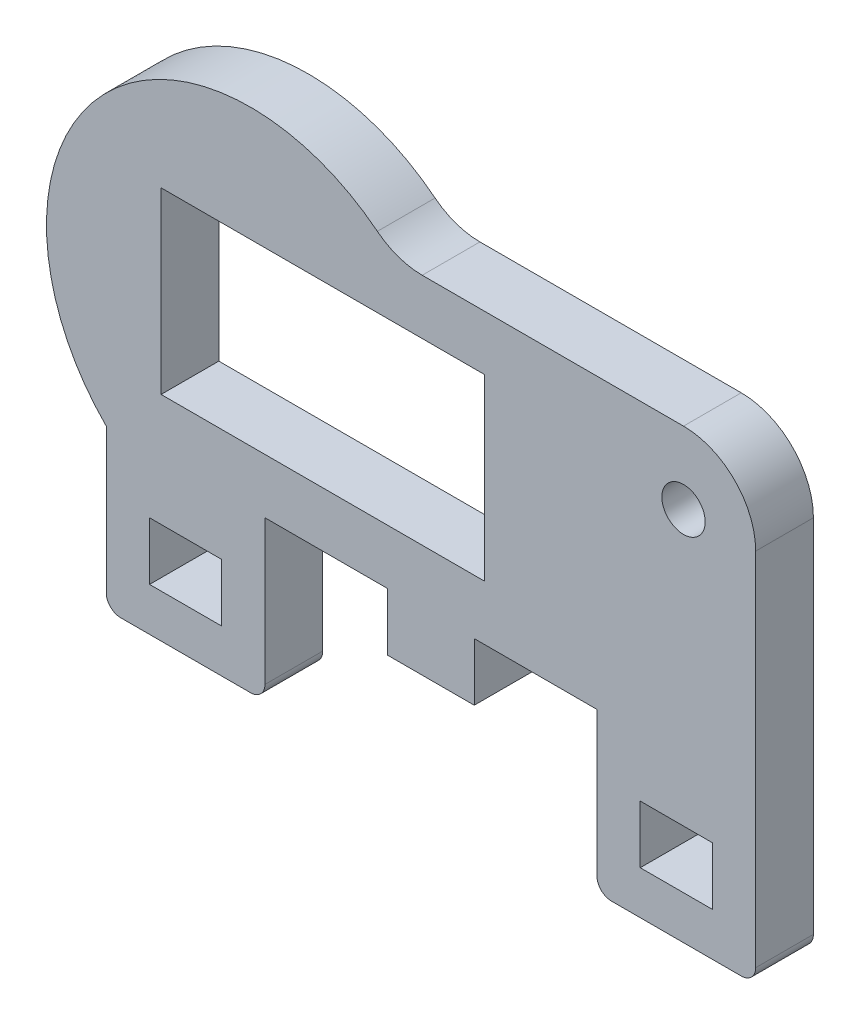
ISO-10303-21;
HEADER;
FILE_DESCRIPTION(('STEP AP214'),'2;1');
FILE_NAME('part.step','',(''),(''),'','','');
FILE_SCHEMA(('AUTOMOTIVE_DESIGN { 1 0 10303 214 1 1 1 1 }'));
ENDSEC;
DATA;
#1=APPLICATION_CONTEXT('core data for automotive mechanical design processes');
#2=APPLICATION_PROTOCOL_DEFINITION('international standard','automotive_design',2000,#1);
#3=PRODUCT_CONTEXT('',#1,'mechanical');
#4=PRODUCT('Part','Part','',(#3));
#5=PRODUCT_RELATED_PRODUCT_CATEGORY('part','',(#4));
#6=PRODUCT_DEFINITION_FORMATION('','',#4);
#7=PRODUCT_DEFINITION_CONTEXT('part definition',#1,'design');
#8=PRODUCT_DEFINITION('design','',#6,#7);
#9=PRODUCT_DEFINITION_SHAPE('','',#8);
#10=(LENGTH_UNIT() NAMED_UNIT(*) SI_UNIT(.MILLI.,.METRE.));
#11=(NAMED_UNIT(*) PLANE_ANGLE_UNIT() SI_UNIT($,.RADIAN.));
#12=(NAMED_UNIT(*) SI_UNIT($,.STERADIAN.) SOLID_ANGLE_UNIT());
#13=UNCERTAINTY_MEASURE_WITH_UNIT(LENGTH_MEASURE(1.E-05),#10,'distance_accuracy_value','');
#14=(GEOMETRIC_REPRESENTATION_CONTEXT(3) GLOBAL_UNCERTAINTY_ASSIGNED_CONTEXT((#13)) GLOBAL_UNIT_ASSIGNED_CONTEXT((#10,
#11,#12)) REPRESENTATION_CONTEXT('',''));
#15=CARTESIAN_POINT('',(0.,0.,0.));
#16=DIRECTION('',(0.,0.,1.));
#17=DIRECTION('',(1.,0.,0.));
#18=AXIS2_PLACEMENT_3D('',#15,#16,#17);
#19=CARTESIAN_POINT('',(42.,0.,4.));
#20=DIRECTION('',(-1.,0.,0.));
#21=DIRECTION('',(0.,0.,1.));
#22=AXIS2_PLACEMENT_3D('',#19,#20,#21);
#23=PLANE('',#22);
#24=DIRECTION('',(0.,1.,0.));
#25=VECTOR('',#24,1.);
#26=CARTESIAN_POINT('',(42.,0.,0.));
#27=LINE('',#26,#25);
#28=CARTESIAN_POINT('',(42.,-8.,0.));
#29=VERTEX_POINT('',#28);
#30=CARTESIAN_POINT('',(42.,-4.,0.));
#31=VERTEX_POINT('',#30);
#32=EDGE_CURVE('E392',#29,#31,#27,.T.);
#33=ORIENTED_EDGE('',*,*,#32,.F.);
#34=DIRECTION('',(0.,0.,-1.));
#35=VECTOR('',#34,1.);
#36=CARTESIAN_POINT('',(42.,-8.,4.));
#37=LINE('',#36,#35);
#38=CARTESIAN_POINT('',(42.,-8.,4.));
#39=VERTEX_POINT('',#38);
#40=EDGE_CURVE('E411',#39,#29,#37,.T.);
#41=ORIENTED_EDGE('',*,*,#40,.F.);
#42=DIRECTION('',(0.,1.,0.));
#43=VECTOR('',#42,1.);
#44=CARTESIAN_POINT('',(42.,0.,4.));
#45=LINE('',#44,#43);
#46=CARTESIAN_POINT('',(42.,-4.,4.));
#47=VERTEX_POINT('',#46);
#48=EDGE_CURVE('E320',#39,#47,#45,.T.);
#49=ORIENTED_EDGE('',*,*,#48,.T.);
#50=DIRECTION('',(0.,0.,-1.));
#51=VECTOR('',#50,1.);
#52=CARTESIAN_POINT('',(42.,-4.,4.));
#53=LINE('',#52,#51);
#54=EDGE_CURVE('E403',#47,#31,#53,.T.);
#55=ORIENTED_EDGE('',*,*,#54,.T.);
#56=EDGE_LOOP('',(#33,#41,#49,#55));
#57=FACE_BOUND('',#56,.T.);
#58=ADVANCED_FACE('F36',(#57),#23,.T.);
#59=CARTESIAN_POINT('',(0.,-8.,4.));
#60=DIRECTION('',(0.,1.,0.));
#61=DIRECTION('',(0.,0.,1.));
#62=AXIS2_PLACEMENT_3D('',#59,#60,#61);
#63=PLANE('',#62);
#64=DIRECTION('',(1.,0.,0.));
#65=VECTOR('',#64,1.);
#66=CARTESIAN_POINT('',(0.,-8.,0.));
#67=LINE('',#66,#65);
#68=CARTESIAN_POINT('',(37.,-8.,0.));
#69=VERTEX_POINT('',#68);
#70=EDGE_CURVE('E395',#69,#29,#67,.T.);
#71=ORIENTED_EDGE('',*,*,#70,.F.);
#72=DIRECTION('',(0.,0.,-1.));
#73=VECTOR('',#72,1.);
#74=CARTESIAN_POINT('',(37.,-8.,4.));
#75=LINE('',#74,#73);
#76=CARTESIAN_POINT('',(37.,-8.,4.));
#77=VERTEX_POINT('',#76);
#78=EDGE_CURVE('E409',#77,#69,#75,.T.);
#79=ORIENTED_EDGE('',*,*,#78,.F.);
#80=DIRECTION('',(1.,0.,0.));
#81=VECTOR('',#80,1.);
#82=CARTESIAN_POINT('',(0.,-8.,4.));
#83=LINE('',#82,#81);
#84=EDGE_CURVE('E323',#77,#39,#83,.T.);
#85=ORIENTED_EDGE('',*,*,#84,.T.);
#86=ORIENTED_EDGE('',*,*,#40,.T.);
#87=EDGE_LOOP('',(#71,#79,#85,#86));
#88=FACE_BOUND('',#87,.T.);
#89=ADVANCED_FACE('F576',(#88),#63,.T.);
#90=CARTESIAN_POINT('',(37.,0.,4.));
#91=DIRECTION('',(-1.,0.,0.));
#92=DIRECTION('',(0.,0.,1.));
#93=AXIS2_PLACEMENT_3D('',#90,#91,#92);
#94=PLANE('',#93);
#95=DIRECTION('',(0.,1.,0.));
#96=VECTOR('',#95,1.);
#97=CARTESIAN_POINT('',(37.,0.,0.));
#98=LINE('',#97,#96);
#99=CARTESIAN_POINT('',(37.,-4.,0.));
#100=VERTEX_POINT('',#99);
#101=EDGE_CURVE('E398',#69,#100,#98,.T.);
#102=ORIENTED_EDGE('',*,*,#101,.T.);
#103=DIRECTION('',(0.,0.,-1.));
#104=VECTOR('',#103,1.);
#105=CARTESIAN_POINT('',(37.,-4.,4.));
#106=LINE('',#105,#104);
#107=CARTESIAN_POINT('',(37.,-4.,4.));
#108=VERTEX_POINT('',#107);
#109=EDGE_CURVE('E405',#108,#100,#106,.T.);
#110=ORIENTED_EDGE('',*,*,#109,.F.);
#111=DIRECTION('',(0.,1.,0.));
#112=VECTOR('',#111,1.);
#113=CARTESIAN_POINT('',(37.,0.,4.));
#114=LINE('',#113,#112);
#115=EDGE_CURVE('E326',#77,#108,#114,.T.);
#116=ORIENTED_EDGE('',*,*,#115,.F.);
#117=ORIENTED_EDGE('',*,*,#78,.T.);
#118=EDGE_LOOP('',(#102,#110,#116,#117));
#119=FACE_BOUND('',#118,.T.);
#120=ADVANCED_FACE('F582',(#119),#94,.F.);
#121=CARTESIAN_POINT('',(0.,16.2,4.));
#122=DIRECTION('',(0.,1.,0.));
#123=DIRECTION('',(-1.,0.,0.));
#124=AXIS2_PLACEMENT_3D('',#121,#122,#123);
#125=PLANE('',#124);
#126=DIRECTION('',(1.,0.,0.));
#127=VECTOR('',#126,1.);
#128=CARTESIAN_POINT('',(0.,16.2,0.));
#129=LINE('',#128,#127);
#130=CARTESIAN_POINT('',(3.8,16.2,0.));
#131=VERTEX_POINT('',#130);
#132=CARTESIAN_POINT('',(26.22,16.2,0.));
#133=VERTEX_POINT('',#132);
#134=EDGE_CURVE('E377',#131,#133,#129,.T.);
#135=ORIENTED_EDGE('',*,*,#134,.T.);
#136=DIRECTION('',(0.,0.,-1.));
#137=VECTOR('',#136,1.);
#138=CARTESIAN_POINT('',(26.22,16.2,4.));
#139=LINE('',#138,#137);
#140=CARTESIAN_POINT('',(26.22,16.2,4.));
#141=VERTEX_POINT('',#140);
#142=EDGE_CURVE('E406',#141,#133,#139,.T.);
#143=ORIENTED_EDGE('',*,*,#142,.F.);
#144=DIRECTION('',(1.,0.,0.));
#145=VECTOR('',#144,1.);
#146=CARTESIAN_POINT('',(0.,16.2,4.));
#147=LINE('',#146,#145);
#148=CARTESIAN_POINT('',(3.8,16.2,4.));
#149=VERTEX_POINT('',#148);
#150=EDGE_CURVE('E306',#149,#141,#147,.T.);
#151=ORIENTED_EDGE('',*,*,#150,.F.);
#152=DIRECTION('',(0.,0.,-1.));
#153=VECTOR('',#152,1.);
#154=CARTESIAN_POINT('',(3.8,16.2,4.));
#155=LINE('',#154,#153);
#156=EDGE_CURVE('E414',#149,#131,#155,.T.);
#157=ORIENTED_EDGE('',*,*,#156,.T.);
#158=EDGE_LOOP('',(#135,#143,#151,#157));
#159=FACE_BOUND('',#158,.T.);
#160=ADVANCED_FACE('F604',(#159),#125,.F.);
#161=CARTESIAN_POINT('',(26.22,0.,4.));
#162=DIRECTION('',(1.,0.,0.));
#163=DIRECTION('',(0.,1.,0.));
#164=AXIS2_PLACEMENT_3D('',#161,#162,#163);
#165=PLANE('',#164);
#166=DIRECTION('',(0.,-1.,0.));
#167=VECTOR('',#166,1.);
#168=CARTESIAN_POINT('',(26.22,0.,0.));
#169=LINE('',#168,#167);
#170=CARTESIAN_POINT('',(26.22,3.8,0.));
#171=VERTEX_POINT('',#170);
#172=EDGE_CURVE('E380',#133,#171,#169,.T.);
#173=ORIENTED_EDGE('',*,*,#172,.T.);
#174=DIRECTION('',(0.,0.,-1.));
#175=VECTOR('',#174,1.);
#176=CARTESIAN_POINT('',(26.22,3.8,4.));
#177=LINE('',#176,#175);
#178=CARTESIAN_POINT('',(26.22,3.8,4.));
#179=VERTEX_POINT('',#178);
#180=EDGE_CURVE('E419',#179,#171,#177,.T.);
#181=ORIENTED_EDGE('',*,*,#180,.F.);
#182=DIRECTION('',(0.,-1.,0.));
#183=VECTOR('',#182,1.);
#184=CARTESIAN_POINT('',(26.22,0.,4.));
#185=LINE('',#184,#183);
#186=EDGE_CURVE('E309',#141,#179,#185,.T.);
#187=ORIENTED_EDGE('',*,*,#186,.F.);
#188=ORIENTED_EDGE('',*,*,#142,.T.);
#189=EDGE_LOOP('',(#173,#181,#187,#188));
#190=FACE_BOUND('',#189,.T.);
#191=ADVANCED_FACE('F600',(#190),#165,.F.);
#192=CARTESIAN_POINT('',(0.,3.8,4.));
#193=DIRECTION('',(0.,1.,0.));
#194=DIRECTION('',(0.,0.,1.));
#195=AXIS2_PLACEMENT_3D('',#192,#193,#194);
#196=PLANE('',#195);
#197=DIRECTION('',(1.,0.,0.));
#198=VECTOR('',#197,1.);
#199=CARTESIAN_POINT('',(0.,3.8,0.));
#200=LINE('',#199,#198);
#201=CARTESIAN_POINT('',(3.8,3.8,0.));
#202=VERTEX_POINT('',#201);
#203=EDGE_CURVE('E383',#202,#171,#200,.T.);
#204=ORIENTED_EDGE('',*,*,#203,.F.);
#205=DIRECTION('',(0.,0.,-1.));
#206=VECTOR('',#205,1.);
#207=CARTESIAN_POINT('',(3.8,3.8,4.));
#208=LINE('',#207,#206);
#209=CARTESIAN_POINT('',(3.8,3.8,4.));
#210=VERTEX_POINT('',#209);
#211=EDGE_CURVE('E416',#210,#202,#208,.T.);
#212=ORIENTED_EDGE('',*,*,#211,.F.);
#213=DIRECTION('',(1.,0.,0.));
#214=VECTOR('',#213,1.);
#215=CARTESIAN_POINT('',(0.,3.8,4.));
#216=LINE('',#215,#214);
#217=EDGE_CURVE('E311',#210,#179,#216,.T.);
#218=ORIENTED_EDGE('',*,*,#217,.T.);
#219=ORIENTED_EDGE('',*,*,#180,.T.);
#220=EDGE_LOOP('',(#204,#212,#218,#219));
#221=FACE_BOUND('',#220,.T.);
#222=ADVANCED_FACE('F597',(#221),#196,.T.);
#223=CARTESIAN_POINT('',(0.,20.,4.));
#224=DIRECTION('',(0.,1.,0.));
#225=DIRECTION('',(0.,0.,1.));
#226=AXIS2_PLACEMENT_3D('',#223,#224,#225);
#227=PLANE('',#226);
#228=DIRECTION('',(1.,0.,0.));
#229=VECTOR('',#228,1.);
#230=CARTESIAN_POINT('',(0.,20.,4.));
#231=LINE('',#230,#229);
#232=CARTESIAN_POINT('',(21.8920711500272,20.,4.));
#233=VERTEX_POINT('',#232);
#234=CARTESIAN_POINT('',(40.,20.,4.));
#235=VERTEX_POINT('',#234);
#236=EDGE_CURVE('E270',#233,#235,#231,.T.);
#237=ORIENTED_EDGE('',*,*,#236,.T.);
#238=DIRECTION('',(0.,0.,-1.));
#239=VECTOR('',#238,1.);
#240=CARTESIAN_POINT('',(40.,20.,4.));
#241=LINE('',#240,#239);
#242=CARTESIAN_POINT('',(40.,20.,0.));
#243=VERTEX_POINT('',#242);
#244=EDGE_CURVE('E479',#235,#243,#241,.T.);
#245=ORIENTED_EDGE('',*,*,#244,.T.);
#246=DIRECTION('',(1.,0.,0.));
#247=VECTOR('',#246,1.);
#248=CARTESIAN_POINT('',(0.,20.,0.));
#249=LINE('',#248,#247);
#250=CARTESIAN_POINT('',(21.8920711500272,20.,0.));
#251=VERTEX_POINT('',#250);
#252=EDGE_CURVE('E340',#251,#243,#249,.T.);
#253=ORIENTED_EDGE('',*,*,#252,.F.);
#254=DIRECTION('',(0.,0.,-1.));
#255=VECTOR('',#254,1.);
#256=CARTESIAN_POINT('',(21.8920711500272,20.,4.));
#257=LINE('',#256,#255);
#258=EDGE_CURVE('E477',#251,#233,#257,.F.);
#259=ORIENTED_EDGE('',*,*,#258,.T.);
#260=EDGE_LOOP('',(#237,#245,#253,#259));
#261=FACE_BOUND('',#260,.T.);
#262=ADVANCED_FACE('F499',(#261),#227,.T.);
#263=CARTESIAN_POINT('',(10.,10.,4.));
#264=DIRECTION('',(0.,0.,-1.));
#265=DIRECTION('',(-1.,0.,0.));
#266=AXIS2_PLACEMENT_3D('',#263,#264,#265);
#267=CYLINDRICAL_SURFACE('',#266,14.142135623731);
#268=CARTESIAN_POINT('',(10.,10.,4.));
#269=DIRECTION('',(0.,0.,1.));
#270=DIRECTION('',(1.,0.,0.));
#271=AXIS2_PLACEMENT_3D('',#268,#269,#270);
#272=CIRCLE('',#271,14.142135623731);
#273=CARTESIAN_POINT('',(18.7858160842956,21.0819418755439,4.));
#274=VERTEX_POINT('',#273);
#275=CARTESIAN_POINT('',(0.,0.,4.));
#276=VERTEX_POINT('',#275);
#277=EDGE_CURVE('E273',#274,#276,#272,.T.);
#278=ORIENTED_EDGE('',*,*,#277,.F.);
#279=DIRECTION('',(0.,0.,-1.));
#280=VECTOR('',#279,1.);
#281=CARTESIAN_POINT('',(18.7858160842956,21.0819418755439,4.));
#282=LINE('',#281,#280);
#283=CARTESIAN_POINT('',(18.7858160842956,21.0819418755439,0.));
#284=VERTEX_POINT('',#283);
#285=EDGE_CURVE('E487',#274,#284,#282,.T.);
#286=ORIENTED_EDGE('',*,*,#285,.T.);
#287=CARTESIAN_POINT('',(10.,10.,0.));
#288=DIRECTION('',(0.,0.,1.));
#289=DIRECTION('',(1.,0.,0.));
#290=AXIS2_PLACEMENT_3D('',#287,#288,#289);
#291=CIRCLE('',#290,14.142135623731);
#292=CARTESIAN_POINT('',(0.,0.,0.));
#293=VERTEX_POINT('',#292);
#294=EDGE_CURVE('E343',#284,#293,#291,.T.);
#295=ORIENTED_EDGE('',*,*,#294,.T.);
#296=DIRECTION('',(0.,0.,-1.));
#297=VECTOR('',#296,1.);
#298=CARTESIAN_POINT('',(0.,0.,4.));
#299=LINE('',#298,#297);
#300=EDGE_CURVE('E417',#276,#293,#299,.T.);
#301=ORIENTED_EDGE('',*,*,#300,.F.);
#302=EDGE_LOOP('',(#278,#286,#295,#301));
#303=FACE_BOUND('',#302,.T.);
#304=ADVANCED_FACE('F502',(#303),#267,.T.);
#305=CARTESIAN_POINT('',(0.,0.,4.));
#306=DIRECTION('',(1.,0.,0.));
#307=DIRECTION('',(0.,1.,0.));
#308=AXIS2_PLACEMENT_3D('',#305,#306,#307);
#309=PLANE('',#308);
#310=DIRECTION('',(0.,-1.,0.));
#311=VECTOR('',#310,1.);
#312=CARTESIAN_POINT('',(0.,0.,0.));
#313=LINE('',#312,#311);
#314=CARTESIAN_POINT('',(0.,-10.,0.));
#315=VERTEX_POINT('',#314);
#316=EDGE_CURVE('E345',#293,#315,#313,.T.);
#317=ORIENTED_EDGE('',*,*,#316,.T.);
#318=DIRECTION('',(0.,0.,-1.));
#319=VECTOR('',#318,1.);
#320=CARTESIAN_POINT('',(0.,-10.,4.));
#321=LINE('',#320,#319);
#322=CARTESIAN_POINT('',(0.,-10.,4.));
#323=VERTEX_POINT('',#322);
#324=EDGE_CURVE('E472',#315,#323,#321,.F.);
#325=ORIENTED_EDGE('',*,*,#324,.T.);
#326=DIRECTION('',(0.,-1.,0.));
#327=VECTOR('',#326,1.);
#328=CARTESIAN_POINT('',(0.,0.,4.));
#329=LINE('',#328,#327);
#330=EDGE_CURVE('E275',#276,#323,#329,.T.);
#331=ORIENTED_EDGE('',*,*,#330,.F.);
#332=ORIENTED_EDGE('',*,*,#300,.T.);
#333=EDGE_LOOP('',(#317,#325,#331,#332));
#334=FACE_BOUND('',#333,.T.);
#335=ADVANCED_FACE('F508',(#334),#309,.F.);
#336=CARTESIAN_POINT('',(0.,-11.,4.));
#337=DIRECTION('',(0.,1.,0.));
#338=DIRECTION('',(-1.,0.,0.));
#339=AXIS2_PLACEMENT_3D('',#336,#337,#338);
#340=PLANE('',#339);
#341=DIRECTION('',(1.,0.,0.));
#342=VECTOR('',#341,1.);
#343=CARTESIAN_POINT('',(0.,-11.,4.));
#344=LINE('',#343,#342);
#345=CARTESIAN_POINT('',(1.,-11.,4.));
#346=VERTEX_POINT('',#345);
#347=CARTESIAN_POINT('',(10.,-11.,4.));
#348=VERTEX_POINT('',#347);
#349=EDGE_CURVE('E278',#346,#348,#344,.T.);
#350=ORIENTED_EDGE('',*,*,#349,.F.);
#351=DIRECTION('',(0.,0.,-1.));
#352=VECTOR('',#351,1.);
#353=CARTESIAN_POINT('',(1.,-11.,4.));
#354=LINE('',#353,#352);
#355=CARTESIAN_POINT('',(1.,-11.,0.));
#356=VERTEX_POINT('',#355);
#357=EDGE_CURVE('E469',#346,#356,#354,.T.);
#358=ORIENTED_EDGE('',*,*,#357,.T.);
#359=DIRECTION('',(1.,0.,0.));
#360=VECTOR('',#359,1.);
#361=CARTESIAN_POINT('',(0.,-11.,0.));
#362=LINE('',#361,#360);
#363=CARTESIAN_POINT('',(10.,-11.,0.));
#364=VERTEX_POINT('',#363);
#365=EDGE_CURVE('E348',#356,#364,#362,.T.);
#366=ORIENTED_EDGE('',*,*,#365,.T.);
#367=DIRECTION('',(0.,0.,-1.));
#368=VECTOR('',#367,1.);
#369=CARTESIAN_POINT('',(10.,-11.,4.));
#370=LINE('',#369,#368);
#371=EDGE_CURVE('E467',#364,#348,#370,.F.);
#372=ORIENTED_EDGE('',*,*,#371,.T.);
#373=EDGE_LOOP('',(#350,#358,#366,#372));
#374=FACE_BOUND('',#373,.T.);
#375=ADVANCED_FACE('F516',(#374),#340,.F.);
#376=CARTESIAN_POINT('',(11.,0.,4.));
#377=DIRECTION('',(1.,0.,0.));
#378=DIRECTION('',(0.,1.,0.));
#379=AXIS2_PLACEMENT_3D('',#376,#377,#378);
#380=PLANE('',#379);
#381=DIRECTION('',(0.,-1.,0.));
#382=VECTOR('',#381,1.);
#383=CARTESIAN_POINT('',(11.,0.,4.));
#384=LINE('',#383,#382);
#385=CARTESIAN_POINT('',(11.,0.,4.));
#386=VERTEX_POINT('',#385);
#387=CARTESIAN_POINT('',(11.,-9.99999999999999,4.));
#388=VERTEX_POINT('',#387);
#389=EDGE_CURVE('E281',#386,#388,#384,.T.);
#390=ORIENTED_EDGE('',*,*,#389,.T.);
#391=DIRECTION('',(0.,0.,-1.));
#392=VECTOR('',#391,1.);
#393=CARTESIAN_POINT('',(11.,-9.99999999999999,0.));
#394=LINE('',#393,#392);
#395=CARTESIAN_POINT('',(11.,-9.99999999999999,0.));
#396=VERTEX_POINT('',#395);
#397=EDGE_CURVE('E474',#388,#396,#394,.T.);
#398=ORIENTED_EDGE('',*,*,#397,.T.);
#399=DIRECTION('',(0.,-1.,0.));
#400=VECTOR('',#399,1.);
#401=CARTESIAN_POINT('',(11.,0.,0.));
#402=LINE('',#401,#400);
#403=CARTESIAN_POINT('',(11.,0.,0.));
#404=VERTEX_POINT('',#403);
#405=EDGE_CURVE('E351',#404,#396,#402,.T.);
#406=ORIENTED_EDGE('',*,*,#405,.F.);
#407=DIRECTION('',(0.,0.,-1.));
#408=VECTOR('',#407,1.);
#409=CARTESIAN_POINT('',(11.,0.,4.));
#410=LINE('',#409,#408);
#411=EDGE_CURVE('E433',#386,#404,#410,.T.);
#412=ORIENTED_EDGE('',*,*,#411,.F.);
#413=EDGE_LOOP('',(#390,#398,#406,#412));
#414=FACE_BOUND('',#413,.T.);
#415=ADVANCED_FACE('F525',(#414),#380,.T.);
#416=CARTESIAN_POINT('',(0.,0.,4.));
#417=DIRECTION('',(0.,-1.,0.));
#418=DIRECTION('',(1.,0.,0.));
#419=AXIS2_PLACEMENT_3D('',#416,#417,#418);
#420=PLANE('',#419);
#421=DIRECTION('',(-1.,0.,0.));
#422=VECTOR('',#421,1.);
#423=CARTESIAN_POINT('',(0.,0.,0.));
#424=LINE('',#423,#422);
#425=CARTESIAN_POINT('',(19.5,0.,0.));
#426=VERTEX_POINT('',#425);
#427=EDGE_CURVE('E354',#426,#404,#424,.T.);
#428=ORIENTED_EDGE('',*,*,#427,.F.);
#429=DIRECTION('',(0.,0.,-1.));
#430=VECTOR('',#429,1.);
#431=CARTESIAN_POINT('',(19.5,0.,4.));
#432=LINE('',#431,#430);
#433=CARTESIAN_POINT('',(19.5,0.,4.));
#434=VERTEX_POINT('',#433);
#435=EDGE_CURVE('E431',#434,#426,#432,.T.);
#436=ORIENTED_EDGE('',*,*,#435,.F.);
#437=DIRECTION('',(-1.,0.,0.));
#438=VECTOR('',#437,1.);
#439=CARTESIAN_POINT('',(0.,0.,4.));
#440=LINE('',#439,#438);
#441=EDGE_CURVE('E284',#434,#386,#440,.T.);
#442=ORIENTED_EDGE('',*,*,#441,.T.);
#443=ORIENTED_EDGE('',*,*,#411,.T.);
#444=EDGE_LOOP('',(#428,#436,#442,#443));
#445=FACE_BOUND('',#444,.T.);
#446=ADVANCED_FACE('F529',(#445),#420,.T.);
#447=CARTESIAN_POINT('',(19.5,0.,4.));
#448=DIRECTION('',(1.,0.,0.));
#449=DIRECTION('',(0.,1.,0.));
#450=AXIS2_PLACEMENT_3D('',#447,#448,#449);
#451=PLANE('',#450);
#452=DIRECTION('',(0.,-1.,0.));
#453=VECTOR('',#452,1.);
#454=CARTESIAN_POINT('',(19.5,0.,0.));
#455=LINE('',#454,#453);
#456=CARTESIAN_POINT('',(19.5,-4.,0.));
#457=VERTEX_POINT('',#456);
#458=EDGE_CURVE('E357',#426,#457,#455,.T.);
#459=ORIENTED_EDGE('',*,*,#458,.T.);
#460=DIRECTION('',(0.,0.,-1.));
#461=VECTOR('',#460,1.);
#462=CARTESIAN_POINT('',(19.5,-4.,4.));
#463=LINE('',#462,#461);
#464=CARTESIAN_POINT('',(19.5,-4.,4.));
#465=VERTEX_POINT('',#464);
#466=EDGE_CURVE('E428',#465,#457,#463,.T.);
#467=ORIENTED_EDGE('',*,*,#466,.F.);
#468=DIRECTION('',(0.,-1.,0.));
#469=VECTOR('',#468,1.);
#470=CARTESIAN_POINT('',(19.5,0.,4.));
#471=LINE('',#470,#469);
#472=EDGE_CURVE('E287',#434,#465,#471,.T.);
#473=ORIENTED_EDGE('',*,*,#472,.F.);
#474=ORIENTED_EDGE('',*,*,#435,.T.);
#475=EDGE_LOOP('',(#459,#467,#473,#474));
#476=FACE_BOUND('',#475,.T.);
#477=ADVANCED_FACE('F535',(#476),#451,.F.);
#478=CARTESIAN_POINT('',(0.,-4.,4.));
#479=DIRECTION('',(0.,1.,0.));
#480=DIRECTION('',(-1.,0.,0.));
#481=AXIS2_PLACEMENT_3D('',#478,#479,#480);
#482=PLANE('',#481);
#483=DIRECTION('',(1.,0.,0.));
#484=VECTOR('',#483,1.);
#485=CARTESIAN_POINT('',(0.,-4.,0.));
#486=LINE('',#485,#484);
#487=CARTESIAN_POINT('',(25.5,-4.,0.));
#488=VERTEX_POINT('',#487);
#489=EDGE_CURVE('E360',#457,#488,#486,.T.);
#490=ORIENTED_EDGE('',*,*,#489,.T.);
#491=DIRECTION('',(0.,0.,-1.));
#492=VECTOR('',#491,1.);
#493=CARTESIAN_POINT('',(25.5,-4.,4.));
#494=LINE('',#493,#492);
#495=CARTESIAN_POINT('',(25.5,-4.,4.));
#496=VERTEX_POINT('',#495);
#497=EDGE_CURVE('E426',#496,#488,#494,.T.);
#498=ORIENTED_EDGE('',*,*,#497,.F.);
#499=DIRECTION('',(1.,0.,0.));
#500=VECTOR('',#499,1.);
#501=CARTESIAN_POINT('',(0.,-4.,4.));
#502=LINE('',#501,#500);
#503=EDGE_CURVE('E290',#465,#496,#502,.T.);
#504=ORIENTED_EDGE('',*,*,#503,.F.);
#505=ORIENTED_EDGE('',*,*,#466,.T.);
#506=EDGE_LOOP('',(#490,#498,#504,#505));
#507=FACE_BOUND('',#506,.T.);
#508=ADVANCED_FACE('F538',(#507),#482,.F.);
#509=CARTESIAN_POINT('',(25.5,0.,4.));
#510=DIRECTION('',(1.,0.,0.));
#511=DIRECTION('',(0.,1.,0.));
#512=AXIS2_PLACEMENT_3D('',#509,#510,#511);
#513=PLANE('',#512);
#514=DIRECTION('',(0.,-1.,0.));
#515=VECTOR('',#514,1.);
#516=CARTESIAN_POINT('',(25.5,0.,0.));
#517=LINE('',#516,#515);
#518=CARTESIAN_POINT('',(25.5,0.,0.));
#519=VERTEX_POINT('',#518);
#520=EDGE_CURVE('E363',#519,#488,#517,.T.);
#521=ORIENTED_EDGE('',*,*,#520,.F.);
#522=DIRECTION('',(0.,0.,-1.));
#523=VECTOR('',#522,1.);
#524=CARTESIAN_POINT('',(25.5,0.,4.));
#525=LINE('',#524,#523);
#526=CARTESIAN_POINT('',(25.5,0.,4.));
#527=VERTEX_POINT('',#526);
#528=EDGE_CURVE('E424',#527,#519,#525,.T.);
#529=ORIENTED_EDGE('',*,*,#528,.F.);
#530=DIRECTION('',(0.,-1.,0.));
#531=VECTOR('',#530,1.);
#532=CARTESIAN_POINT('',(25.5,0.,4.));
#533=LINE('',#532,#531);
#534=EDGE_CURVE('E292',#527,#496,#533,.T.);
#535=ORIENTED_EDGE('',*,*,#534,.T.);
#536=ORIENTED_EDGE('',*,*,#497,.T.);
#537=EDGE_LOOP('',(#521,#529,#535,#536));
#538=FACE_BOUND('',#537,.T.);
#539=ADVANCED_FACE('F541',(#538),#513,.T.);
#540=CARTESIAN_POINT('',(0.,0.,4.));
#541=DIRECTION('',(0.,-1.,0.));
#542=DIRECTION('',(1.,0.,0.));
#543=AXIS2_PLACEMENT_3D('',#540,#541,#542);
#544=PLANE('',#543);
#545=DIRECTION('',(-1.,0.,0.));
#546=VECTOR('',#545,1.);
#547=CARTESIAN_POINT('',(0.,0.,0.));
#548=LINE('',#547,#546);
#549=CARTESIAN_POINT('',(34.,0.,0.));
#550=VERTEX_POINT('',#549);
#551=EDGE_CURVE('E366',#550,#519,#548,.T.);
#552=ORIENTED_EDGE('',*,*,#551,.F.);
#553=DIRECTION('',(0.,0.,-1.));
#554=VECTOR('',#553,1.);
#555=CARTESIAN_POINT('',(34.,0.,4.));
#556=LINE('',#555,#554);
#557=CARTESIAN_POINT('',(34.,0.,4.));
#558=VERTEX_POINT('',#557);
#559=EDGE_CURVE('E261',#558,#550,#556,.T.);
#560=ORIENTED_EDGE('',*,*,#559,.F.);
#561=DIRECTION('',(-1.,0.,0.));
#562=VECTOR('',#561,1.);
#563=CARTESIAN_POINT('',(0.,0.,4.));
#564=LINE('',#563,#562);
#565=EDGE_CURVE('E295',#558,#527,#564,.T.);
#566=ORIENTED_EDGE('',*,*,#565,.T.);
#567=ORIENTED_EDGE('',*,*,#528,.T.);
#568=EDGE_LOOP('',(#552,#560,#566,#567));
#569=FACE_BOUND('',#568,.T.);
#570=ADVANCED_FACE('F545',(#569),#544,.T.);
#571=CARTESIAN_POINT('',(34.,0.,4.));
#572=DIRECTION('',(1.,0.,0.));
#573=DIRECTION('',(0.,1.,0.));
#574=AXIS2_PLACEMENT_3D('',#571,#572,#573);
#575=PLANE('',#574);
#576=DIRECTION('',(0.,-1.,0.));
#577=VECTOR('',#576,1.);
#578=CARTESIAN_POINT('',(34.,0.,0.));
#579=LINE('',#578,#577);
#580=CARTESIAN_POINT('',(34.,-9.99999999999999,0.));
#581=VERTEX_POINT('',#580);
#582=EDGE_CURVE('E369',#550,#581,#579,.T.);
#583=ORIENTED_EDGE('',*,*,#582,.T.);
#584=DIRECTION('',(0.,0.,-1.));
#585=VECTOR('',#584,1.);
#586=CARTESIAN_POINT('',(34.,-9.99999999999999,4.));
#587=LINE('',#586,#585);
#588=CARTESIAN_POINT('',(34.,-9.99999999999999,4.));
#589=VERTEX_POINT('',#588);
#590=EDGE_CURVE('E465',#581,#589,#587,.F.);
#591=ORIENTED_EDGE('',*,*,#590,.T.);
#592=DIRECTION('',(0.,-1.,0.));
#593=VECTOR('',#592,1.);
#594=CARTESIAN_POINT('',(34.,0.,4.));
#595=LINE('',#594,#593);
#596=EDGE_CURVE('E298',#558,#589,#595,.T.);
#597=ORIENTED_EDGE('',*,*,#596,.F.);
#598=ORIENTED_EDGE('',*,*,#559,.T.);
#599=EDGE_LOOP('',(#583,#591,#597,#598));
#600=FACE_BOUND('',#599,.T.);
#601=ADVANCED_FACE('F549',(#600),#575,.F.);
#602=CARTESIAN_POINT('',(0.,-11.,4.));
#603=DIRECTION('',(0.,-1.,0.));
#604=DIRECTION('',(1.,0.,0.));
#605=AXIS2_PLACEMENT_3D('',#602,#603,#604);
#606=PLANE('',#605);
#607=DIRECTION('',(-1.,0.,0.));
#608=VECTOR('',#607,1.);
#609=CARTESIAN_POINT('',(0.,-11.,0.));
#610=LINE('',#609,#608);
#611=CARTESIAN_POINT('',(44.,-11.,0.));
#612=VERTEX_POINT('',#611);
#613=CARTESIAN_POINT('',(35.,-11.,0.));
#614=VERTEX_POINT('',#613);
#615=EDGE_CURVE('E372',#612,#614,#610,.T.);
#616=ORIENTED_EDGE('',*,*,#615,.F.);
#617=DIRECTION('',(0.,0.,-1.));
#618=VECTOR('',#617,1.);
#619=CARTESIAN_POINT('',(44.,-11.,4.));
#620=LINE('',#619,#618);
#621=CARTESIAN_POINT('',(44.,-11.,4.));
#622=VERTEX_POINT('',#621);
#623=EDGE_CURVE('E454',#612,#622,#620,.F.);
#624=ORIENTED_EDGE('',*,*,#623,.T.);
#625=DIRECTION('',(-1.,0.,0.));
#626=VECTOR('',#625,1.);
#627=CARTESIAN_POINT('',(0.,-11.,4.));
#628=LINE('',#627,#626);
#629=CARTESIAN_POINT('',(35.,-11.,4.));
#630=VERTEX_POINT('',#629);
#631=EDGE_CURVE('E301',#622,#630,#628,.T.);
#632=ORIENTED_EDGE('',*,*,#631,.T.);
#633=DIRECTION('',(0.,0.,-1.));
#634=VECTOR('',#633,1.);
#635=CARTESIAN_POINT('',(35.,-11.,0.));
#636=LINE('',#635,#634);
#637=EDGE_CURVE('E451',#630,#614,#636,.T.);
#638=ORIENTED_EDGE('',*,*,#637,.T.);
#639=EDGE_LOOP('',(#616,#624,#632,#638));
#640=FACE_BOUND('',#639,.T.);
#641=ADVANCED_FACE('F558',(#640),#606,.T.);
#642=CARTESIAN_POINT('',(0.,-4.,4.));
#643=DIRECTION('',(0.,1.,0.));
#644=DIRECTION('',(0.,0.,1.));
#645=AXIS2_PLACEMENT_3D('',#642,#643,#644);
#646=PLANE('',#645);
#647=DIRECTION('',(1.,0.,0.));
#648=VECTOR('',#647,1.);
#649=CARTESIAN_POINT('',(0.,-4.,0.));
#650=LINE('',#649,#648);
#651=CARTESIAN_POINT('',(3.00000000000001,-4.,0.));
#652=VERTEX_POINT('',#651);
#653=CARTESIAN_POINT('',(8.,-4.,0.));
#654=VERTEX_POINT('',#653);
#655=EDGE_CURVE('E257',#652,#654,#650,.T.);
#656=ORIENTED_EDGE('',*,*,#655,.T.);
#657=DIRECTION('',(0.,0.,-1.));
#658=VECTOR('',#657,1.);
#659=CARTESIAN_POINT('',(8.,-4.,4.));
#660=LINE('',#659,#658);
#661=CARTESIAN_POINT('',(8.,-4.,4.));
#662=VERTEX_POINT('',#661);
#663=EDGE_CURVE('E254',#662,#654,#660,.T.);
#664=ORIENTED_EDGE('',*,*,#663,.F.);
#665=DIRECTION('',(1.,0.,0.));
#666=VECTOR('',#665,1.);
#667=CARTESIAN_POINT('',(0.,-4.,4.));
#668=LINE('',#667,#666);
#669=CARTESIAN_POINT('',(3.00000000000001,-4.,4.));
#670=VERTEX_POINT('',#669);
#671=EDGE_CURVE('E239',#670,#662,#668,.T.);
#672=ORIENTED_EDGE('',*,*,#671,.F.);
#673=DIRECTION('',(0.,0.,-1.));
#674=VECTOR('',#673,1.);
#675=CARTESIAN_POINT('',(3.00000000000001,-4.,4.));
#676=LINE('',#675,#674);
#677=EDGE_CURVE('E331',#670,#652,#676,.T.);
#678=ORIENTED_EDGE('',*,*,#677,.T.);
#679=EDGE_LOOP('',(#656,#664,#672,#678));
#680=FACE_BOUND('',#679,.T.);
#681=ADVANCED_FACE('F255',(#680),#646,.F.);
#682=CARTESIAN_POINT('',(8.00000000000001,0.,4.));
#683=DIRECTION('',(-1.,0.,0.));
#684=DIRECTION('',(0.,0.,1.));
#685=AXIS2_PLACEMENT_3D('',#682,#683,#684);
#686=PLANE('',#685);
#687=DIRECTION('',(0.,1.,0.));
#688=VECTOR('',#687,1.);
#689=CARTESIAN_POINT('',(8.00000000000001,0.,0.));
#690=LINE('',#689,#688);
#691=CARTESIAN_POINT('',(8.00000000000001,-8.,0.));
#692=VERTEX_POINT('',#691);
#693=EDGE_CURVE('E333',#692,#654,#690,.T.);
#694=ORIENTED_EDGE('',*,*,#693,.F.);
#695=DIRECTION('',(0.,0.,-1.));
#696=VECTOR('',#695,1.);
#697=CARTESIAN_POINT('',(8.00000000000001,-8.,4.));
#698=LINE('',#697,#696);
#699=CARTESIAN_POINT('',(8.00000000000001,-8.,4.));
#700=VERTEX_POINT('',#699);
#701=EDGE_CURVE('E262',#700,#692,#698,.T.);
#702=ORIENTED_EDGE('',*,*,#701,.F.);
#703=DIRECTION('',(0.,1.,0.));
#704=VECTOR('',#703,1.);
#705=CARTESIAN_POINT('',(8.00000000000001,0.,4.));
#706=LINE('',#705,#704);
#707=EDGE_CURVE('E244',#700,#662,#706,.T.);
#708=ORIENTED_EDGE('',*,*,#707,.T.);
#709=ORIENTED_EDGE('',*,*,#663,.T.);
#710=EDGE_LOOP('',(#694,#702,#708,#709));
#711=FACE_BOUND('',#710,.T.);
#712=ADVANCED_FACE('F264',(#711),#686,.T.);
#713=CARTESIAN_POINT('',(0.,-8.,4.));
#714=DIRECTION('',(0.,1.,0.));
#715=DIRECTION('',(0.,0.,1.));
#716=AXIS2_PLACEMENT_3D('',#713,#714,#715);
#717=PLANE('',#716);
#718=DIRECTION('',(1.,0.,0.));
#719=VECTOR('',#718,1.);
#720=CARTESIAN_POINT('',(0.,-8.,0.));
#721=LINE('',#720,#719);
#722=CARTESIAN_POINT('',(3.00000000000001,-8.,0.));
#723=VERTEX_POINT('',#722);
#724=EDGE_CURVE('E335',#723,#692,#721,.T.);
#725=ORIENTED_EDGE('',*,*,#724,.F.);
#726=DIRECTION('',(0.,0.,-1.));
#727=VECTOR('',#726,1.);
#728=CARTESIAN_POINT('',(3.00000000000001,-8.,4.));
#729=LINE('',#728,#727);
#730=CARTESIAN_POINT('',(3.00000000000001,-8.,4.));
#731=VERTEX_POINT('',#730);
#732=EDGE_CURVE('E438',#731,#723,#729,.T.);
#733=ORIENTED_EDGE('',*,*,#732,.F.);
#734=DIRECTION('',(1.,0.,0.));
#735=VECTOR('',#734,1.);
#736=CARTESIAN_POINT('',(0.,-8.,4.));
#737=LINE('',#736,#735);
#738=EDGE_CURVE('E265',#731,#700,#737,.T.);
#739=ORIENTED_EDGE('',*,*,#738,.T.);
#740=ORIENTED_EDGE('',*,*,#701,.T.);
#741=EDGE_LOOP('',(#725,#733,#739,#740));
#742=FACE_BOUND('',#741,.T.);
#743=ADVANCED_FACE('F592',(#742),#717,.T.);
#744=CARTESIAN_POINT('',(40.,15.,4.));
#745=DIRECTION('',(0.,0.,-1.));
#746=DIRECTION('',(-1.,0.,0.));
#747=AXIS2_PLACEMENT_3D('',#744,#745,#746);
#748=CYLINDRICAL_SURFACE('',#747,1.5);
#749=CARTESIAN_POINT('',(40.,15.,4.));
#750=DIRECTION('',(0.,0.,1.));
#751=DIRECTION('',(1.,0.,0.));
#752=AXIS2_PLACEMENT_3D('',#749,#750,#751);
#753=CIRCLE('',#752,1.5);
#754=CARTESIAN_POINT('',(41.5,15.,4.));
#755=VERTEX_POINT('',#754);
#756=EDGE_CURVE('E317',#755,#755,#753,.T.);
#757=ORIENTED_EDGE('',*,*,#756,.T.);
#758=EDGE_LOOP('',(#757));
#759=FACE_BOUND('',#758,.T.);
#760=CARTESIAN_POINT('',(40.,15.,0.));
#761=DIRECTION('',(0.,0.,1.));
#762=DIRECTION('',(1.,0.,0.));
#763=AXIS2_PLACEMENT_3D('',#760,#761,#762);
#764=CIRCLE('',#763,1.5);
#765=CARTESIAN_POINT('',(41.5,15.,0.));
#766=VERTEX_POINT('',#765);
#767=EDGE_CURVE('E389',#766,#766,#764,.T.);
#768=ORIENTED_EDGE('',*,*,#767,.F.);
#769=EDGE_LOOP('',(#768));
#770=FACE_BOUND('',#769,.T.);
#771=ADVANCED_FACE('F588',(#759,#770),#748,.F.);
#772=CARTESIAN_POINT('',(3.8,0.,4.));
#773=DIRECTION('',(1.,0.,0.));
#774=DIRECTION('',(0.,1.,0.));
#775=AXIS2_PLACEMENT_3D('',#772,#773,#774);
#776=PLANE('',#775);
#777=DIRECTION('',(0.,-1.,0.));
#778=VECTOR('',#777,1.);
#779=CARTESIAN_POINT('',(3.8,0.,0.));
#780=LINE('',#779,#778);
#781=EDGE_CURVE('E386',#131,#202,#780,.T.);
#782=ORIENTED_EDGE('',*,*,#781,.F.);
#783=ORIENTED_EDGE('',*,*,#156,.F.);
#784=DIRECTION('',(0.,-1.,0.));
#785=VECTOR('',#784,1.);
#786=CARTESIAN_POINT('',(3.8,0.,4.));
#787=LINE('',#786,#785);
#788=EDGE_CURVE('E314',#149,#210,#787,.T.);
#789=ORIENTED_EDGE('',*,*,#788,.T.);
#790=ORIENTED_EDGE('',*,*,#211,.T.);
#791=EDGE_LOOP('',(#782,#783,#789,#790));
#792=FACE_BOUND('',#791,.T.);
#793=ADVANCED_FACE('F591',(#792),#776,.T.);
#794=CARTESIAN_POINT('',(45.,0.,4.));
#795=DIRECTION('',(1.,0.,0.));
#796=DIRECTION('',(0.,0.,-1.));
#797=AXIS2_PLACEMENT_3D('',#794,#795,#796);
#798=PLANE('',#797);
#799=DIRECTION('',(0.,-1.,0.));
#800=VECTOR('',#799,1.);
#801=CARTESIAN_POINT('',(45.,0.,0.));
#802=LINE('',#801,#800);
#803=CARTESIAN_POINT('',(45.,15.,0.));
#804=VERTEX_POINT('',#803);
#805=CARTESIAN_POINT('',(45.,-10.,0.));
#806=VERTEX_POINT('',#805);
#807=EDGE_CURVE('E375',#804,#806,#802,.T.);
#808=ORIENTED_EDGE('',*,*,#807,.F.);
#809=DIRECTION('',(0.,0.,-1.));
#810=VECTOR('',#809,1.);
#811=CARTESIAN_POINT('',(45.,15.,4.));
#812=LINE('',#811,#810);
#813=CARTESIAN_POINT('',(45.,15.,4.));
#814=VERTEX_POINT('',#813);
#815=EDGE_CURVE('E57',#804,#814,#812,.F.);
#816=ORIENTED_EDGE('',*,*,#815,.T.);
#817=DIRECTION('',(0.,-1.,0.));
#818=VECTOR('',#817,1.);
#819=CARTESIAN_POINT('',(45.,0.,4.));
#820=LINE('',#819,#818);
#821=CARTESIAN_POINT('',(45.,-10.,4.));
#822=VERTEX_POINT('',#821);
#823=EDGE_CURVE('E304',#814,#822,#820,.T.);
#824=ORIENTED_EDGE('',*,*,#823,.T.);
#825=DIRECTION('',(0.,0.,-1.));
#826=VECTOR('',#825,1.);
#827=CARTESIAN_POINT('',(45.,-10.,4.));
#828=LINE('',#827,#826);
#829=EDGE_CURVE('E413',#822,#806,#828,.T.);
#830=ORIENTED_EDGE('',*,*,#829,.T.);
#831=EDGE_LOOP('',(#808,#816,#824,#830));
#832=FACE_BOUND('',#831,.T.);
#833=ADVANCED_FACE('F565',(#832),#798,.T.);
#834=CARTESIAN_POINT('',(3.00000000000001,0.,4.));
#835=DIRECTION('',(-1.,0.,0.));
#836=DIRECTION('',(0.,0.,1.));
#837=AXIS2_PLACEMENT_3D('',#834,#835,#836);
#838=PLANE('',#837);
#839=DIRECTION('',(0.,1.,0.));
#840=VECTOR('',#839,1.);
#841=CARTESIAN_POINT('',(3.00000000000001,0.,0.));
#842=LINE('',#841,#840);
#843=EDGE_CURVE('E338',#723,#652,#842,.T.);
#844=ORIENTED_EDGE('',*,*,#843,.T.);
#845=ORIENTED_EDGE('',*,*,#677,.F.);
#846=DIRECTION('',(0.,1.,0.));
#847=VECTOR('',#846,1.);
#848=CARTESIAN_POINT('',(3.00000000000001,0.,4.));
#849=LINE('',#848,#847);
#850=EDGE_CURVE('E247',#731,#670,#849,.T.);
#851=ORIENTED_EDGE('',*,*,#850,.F.);
#852=ORIENTED_EDGE('',*,*,#732,.T.);
#853=EDGE_LOOP('',(#844,#845,#851,#852));
#854=FACE_BOUND('',#853,.T.);
#855=ADVANCED_FACE('F611',(#854),#838,.F.);
#856=CARTESIAN_POINT('',(0.,-4.,4.));
#857=DIRECTION('',(0.,1.,0.));
#858=DIRECTION('',(0.,0.,1.));
#859=AXIS2_PLACEMENT_3D('',#856,#857,#858);
#860=PLANE('',#859);
#861=DIRECTION('',(1.,0.,0.));
#862=VECTOR('',#861,1.);
#863=CARTESIAN_POINT('',(0.,-4.,0.));
#864=LINE('',#863,#862);
#865=EDGE_CURVE('E251',#100,#31,#864,.T.);
#866=ORIENTED_EDGE('',*,*,#865,.T.);
#867=ORIENTED_EDGE('',*,*,#54,.F.);
#868=DIRECTION('',(1.,0.,0.));
#869=VECTOR('',#868,1.);
#870=CARTESIAN_POINT('',(0.,-4.,4.));
#871=LINE('',#870,#869);
#872=EDGE_CURVE('E329',#108,#47,#871,.T.);
#873=ORIENTED_EDGE('',*,*,#872,.F.);
#874=ORIENTED_EDGE('',*,*,#109,.T.);
#875=EDGE_LOOP('',(#866,#867,#873,#874));
#876=FACE_BOUND('',#875,.T.);
#877=ADVANCED_FACE('F638',(#876),#860,.F.);
#878=CARTESIAN_POINT('',(0.,0.,4.));
#879=DIRECTION('',(0.,0.,1.));
#880=DIRECTION('',(1.,0.,0.));
#881=AXIS2_PLACEMENT_3D('',#878,#879,#880);
#882=PLANE('',#881);
#883=ORIENTED_EDGE('',*,*,#671,.T.);
#884=ORIENTED_EDGE('',*,*,#707,.F.);
#885=ORIENTED_EDGE('',*,*,#738,.F.);
#886=ORIENTED_EDGE('',*,*,#850,.T.);
#887=EDGE_LOOP('',(#883,#884,#885,#886));
#888=FACE_BOUND('',#887,.T.);
#889=ORIENTED_EDGE('',*,*,#823,.F.);
#890=CARTESIAN_POINT('',(40.,15.,4.));
#891=DIRECTION('',(0.,0.,1.));
#892=DIRECTION('',(1.,0.,0.));
#893=AXIS2_PLACEMENT_3D('',#890,#891,#892);
#894=CIRCLE('',#893,5.);
#895=EDGE_CURVE('E485',#814,#235,#894,.T.);
#896=ORIENTED_EDGE('',*,*,#895,.T.);
#897=ORIENTED_EDGE('',*,*,#236,.F.);
#898=CARTESIAN_POINT('',(21.8920711500272,25.,4.));
#899=DIRECTION('',(0.,0.,1.));
#900=DIRECTION('',(1.,0.,0.));
#901=AXIS2_PLACEMENT_3D('',#898,#899,#900);
#902=CIRCLE('',#901,5.);
#903=EDGE_CURVE('E11',#233,#274,#902,.F.);
#904=ORIENTED_EDGE('',*,*,#903,.T.);
#905=ORIENTED_EDGE('',*,*,#277,.T.);
#906=ORIENTED_EDGE('',*,*,#330,.T.);
#907=CARTESIAN_POINT('',(1.,-10.,4.));
#908=DIRECTION('',(0.,0.,1.));
#909=DIRECTION('',(1.,0.,0.));
#910=AXIS2_PLACEMENT_3D('',#907,#908,#909);
#911=CIRCLE('',#910,1.);
#912=EDGE_CURVE('E458',#323,#346,#911,.T.);
#913=ORIENTED_EDGE('',*,*,#912,.T.);
#914=ORIENTED_EDGE('',*,*,#349,.T.);
#915=CARTESIAN_POINT('',(10.,-9.99999999999999,4.));
#916=DIRECTION('',(0.,0.,1.));
#917=DIRECTION('',(1.,0.,0.));
#918=AXIS2_PLACEMENT_3D('',#915,#916,#917);
#919=CIRCLE('',#918,1.);
#920=EDGE_CURVE('E456',#348,#388,#919,.T.);
#921=ORIENTED_EDGE('',*,*,#920,.T.);
#922=ORIENTED_EDGE('',*,*,#389,.F.);
#923=ORIENTED_EDGE('',*,*,#441,.F.);
#924=ORIENTED_EDGE('',*,*,#472,.T.);
#925=ORIENTED_EDGE('',*,*,#503,.T.);
#926=ORIENTED_EDGE('',*,*,#534,.F.);
#927=ORIENTED_EDGE('',*,*,#565,.F.);
#928=ORIENTED_EDGE('',*,*,#596,.T.);
#929=CARTESIAN_POINT('',(35.,-9.99999999999999,4.));
#930=DIRECTION('',(0.,0.,1.));
#931=DIRECTION('',(1.,0.,0.));
#932=AXIS2_PLACEMENT_3D('',#929,#930,#931);
#933=CIRCLE('',#932,1.);
#934=EDGE_CURVE('E460',#589,#630,#933,.T.);
#935=ORIENTED_EDGE('',*,*,#934,.T.);
#936=ORIENTED_EDGE('',*,*,#631,.F.);
#937=CARTESIAN_POINT('',(44.,-10.,4.));
#938=DIRECTION('',(0.,0.,1.));
#939=DIRECTION('',(1.,0.,0.));
#940=AXIS2_PLACEMENT_3D('',#937,#938,#939);
#941=CIRCLE('',#940,1.);
#942=EDGE_CURVE('E462',#622,#822,#941,.T.);
#943=ORIENTED_EDGE('',*,*,#942,.T.);
#944=EDGE_LOOP('',(#889,#896,#897,#904,#905,#906,#913,#914,#921,#922,#923,#924,#925,#926,#927,
#928,#935,#936,#943));
#945=FACE_BOUND('',#944,.T.);
#946=ORIENTED_EDGE('',*,*,#150,.T.);
#947=ORIENTED_EDGE('',*,*,#186,.T.);
#948=ORIENTED_EDGE('',*,*,#217,.F.);
#949=ORIENTED_EDGE('',*,*,#788,.F.);
#950=EDGE_LOOP('',(#946,#947,#948,#949));
#951=FACE_BOUND('',#950,.T.);
#952=ORIENTED_EDGE('',*,*,#756,.F.);
#953=EDGE_LOOP('',(#952));
#954=FACE_BOUND('',#953,.T.);
#955=ORIENTED_EDGE('',*,*,#48,.F.);
#956=ORIENTED_EDGE('',*,*,#84,.F.);
#957=ORIENTED_EDGE('',*,*,#115,.T.);
#958=ORIENTED_EDGE('',*,*,#872,.T.);
#959=EDGE_LOOP('',(#955,#956,#957,#958));
#960=FACE_BOUND('',#959,.T.);
#961=ADVANCED_FACE('F241',(#888,#945,#951,#954,#960),#882,.T.);
#962=CARTESIAN_POINT('',(0.,0.,0.));
#963=DIRECTION('',(0.,0.,1.));
#964=DIRECTION('',(1.,0.,0.));
#965=AXIS2_PLACEMENT_3D('',#962,#963,#964);
#966=PLANE('',#965);
#967=ORIENTED_EDGE('',*,*,#655,.F.);
#968=ORIENTED_EDGE('',*,*,#843,.F.);
#969=ORIENTED_EDGE('',*,*,#724,.T.);
#970=ORIENTED_EDGE('',*,*,#693,.T.);
#971=EDGE_LOOP('',(#967,#968,#969,#970));
#972=FACE_BOUND('',#971,.T.);
#973=ORIENTED_EDGE('',*,*,#252,.T.);
#974=CARTESIAN_POINT('',(40.,15.,0.));
#975=DIRECTION('',(0.,0.,1.));
#976=DIRECTION('',(1.,0.,0.));
#977=AXIS2_PLACEMENT_3D('',#974,#975,#976);
#978=CIRCLE('',#977,5.);
#979=EDGE_CURVE('E482',#243,#804,#978,.F.);
#980=ORIENTED_EDGE('',*,*,#979,.T.);
#981=ORIENTED_EDGE('',*,*,#807,.T.);
#982=CARTESIAN_POINT('',(44.,-10.,0.));
#983=DIRECTION('',(0.,0.,1.));
#984=DIRECTION('',(1.,0.,0.));
#985=AXIS2_PLACEMENT_3D('',#982,#983,#984);
#986=CIRCLE('',#985,1.);
#987=EDGE_CURVE('E449',#806,#612,#986,.F.);
#988=ORIENTED_EDGE('',*,*,#987,.T.);
#989=ORIENTED_EDGE('',*,*,#615,.T.);
#990=CARTESIAN_POINT('',(35.,-9.99999999999999,0.));
#991=DIRECTION('',(0.,0.,1.));
#992=DIRECTION('',(1.,0.,0.));
#993=AXIS2_PLACEMENT_3D('',#990,#991,#992);
#994=CIRCLE('',#993,1.);
#995=EDGE_CURVE('E447',#614,#581,#994,.F.);
#996=ORIENTED_EDGE('',*,*,#995,.T.);
#997=ORIENTED_EDGE('',*,*,#582,.F.);
#998=ORIENTED_EDGE('',*,*,#551,.T.);
#999=ORIENTED_EDGE('',*,*,#520,.T.);
#1000=ORIENTED_EDGE('',*,*,#489,.F.);
#1001=ORIENTED_EDGE('',*,*,#458,.F.);
#1002=ORIENTED_EDGE('',*,*,#427,.T.);
#1003=ORIENTED_EDGE('',*,*,#405,.T.);
#1004=CARTESIAN_POINT('',(10.,-9.99999999999999,0.));
#1005=DIRECTION('',(0.,0.,1.));
#1006=DIRECTION('',(1.,0.,0.));
#1007=AXIS2_PLACEMENT_3D('',#1004,#1005,#1006);
#1008=CIRCLE('',#1007,1.);
#1009=EDGE_CURVE('E443',#396,#364,#1008,.F.);
#1010=ORIENTED_EDGE('',*,*,#1009,.T.);
#1011=ORIENTED_EDGE('',*,*,#365,.F.);
#1012=CARTESIAN_POINT('',(1.,-10.,0.));
#1013=DIRECTION('',(0.,0.,1.));
#1014=DIRECTION('',(1.,0.,0.));
#1015=AXIS2_PLACEMENT_3D('',#1012,#1013,#1014);
#1016=CIRCLE('',#1015,1.);
#1017=EDGE_CURVE('E445',#356,#315,#1016,.F.);
#1018=ORIENTED_EDGE('',*,*,#1017,.T.);
#1019=ORIENTED_EDGE('',*,*,#316,.F.);
#1020=ORIENTED_EDGE('',*,*,#294,.F.);
#1021=CARTESIAN_POINT('',(21.8920711500272,25.,0.));
#1022=DIRECTION('',(0.,0.,1.));
#1023=DIRECTION('',(1.,0.,0.));
#1024=AXIS2_PLACEMENT_3D('',#1021,#1022,#1023);
#1025=CIRCLE('',#1024,5.);
#1026=EDGE_CURVE('E44',#284,#251,#1025,.T.);
#1027=ORIENTED_EDGE('',*,*,#1026,.T.);
#1028=EDGE_LOOP('',(#973,#980,#981,#988,#989,#996,#997,#998,#999,#1000,#1001,#1002,#1003,#1010,
#1011,#1018,#1019,#1020,#1027));
#1029=FACE_BOUND('',#1028,.T.);
#1030=ORIENTED_EDGE('',*,*,#134,.F.);
#1031=ORIENTED_EDGE('',*,*,#781,.T.);
#1032=ORIENTED_EDGE('',*,*,#203,.T.);
#1033=ORIENTED_EDGE('',*,*,#172,.F.);
#1034=EDGE_LOOP('',(#1030,#1031,#1032,#1033));
#1035=FACE_BOUND('',#1034,.T.);
#1036=ORIENTED_EDGE('',*,*,#767,.T.);
#1037=EDGE_LOOP('',(#1036));
#1038=FACE_BOUND('',#1037,.T.);
#1039=ORIENTED_EDGE('',*,*,#32,.T.);
#1040=ORIENTED_EDGE('',*,*,#865,.F.);
#1041=ORIENTED_EDGE('',*,*,#101,.F.);
#1042=ORIENTED_EDGE('',*,*,#70,.T.);
#1043=EDGE_LOOP('',(#1039,#1040,#1041,#1042));
#1044=FACE_BOUND('',#1043,.T.);
#1045=ADVANCED_FACE('F492',(#972,#1029,#1035,#1038,#1044),#966,.F.);
#1046=CARTESIAN_POINT('',(44.,-10.,4.));
#1047=DIRECTION('',(0.,0.,-1.));
#1048=DIRECTION('',(-1.,0.,0.));
#1049=AXIS2_PLACEMENT_3D('',#1046,#1047,#1048);
#1050=CYLINDRICAL_SURFACE('',#1049,1.);
#1051=ORIENTED_EDGE('',*,*,#942,.F.);
#1052=ORIENTED_EDGE('',*,*,#623,.F.);
#1053=ORIENTED_EDGE('',*,*,#987,.F.);
#1054=ORIENTED_EDGE('',*,*,#829,.F.);
#1055=EDGE_LOOP('',(#1051,#1052,#1053,#1054));
#1056=FACE_BOUND('',#1055,.T.);
#1057=ADVANCED_FACE('F564',(#1056),#1050,.T.);
#1058=CARTESIAN_POINT('',(35.,-9.99999999999999,4.));
#1059=DIRECTION('',(0.,0.,1.));
#1060=DIRECTION('',(1.,0.,0.));
#1061=AXIS2_PLACEMENT_3D('',#1058,#1059,#1060);
#1062=CYLINDRICAL_SURFACE('',#1061,1.);
#1063=ORIENTED_EDGE('',*,*,#934,.F.);
#1064=ORIENTED_EDGE('',*,*,#590,.F.);
#1065=ORIENTED_EDGE('',*,*,#995,.F.);
#1066=ORIENTED_EDGE('',*,*,#637,.F.);
#1067=EDGE_LOOP('',(#1063,#1064,#1065,#1066));
#1068=FACE_BOUND('',#1067,.T.);
#1069=ADVANCED_FACE('F555',(#1068),#1062,.T.);
#1070=CARTESIAN_POINT('',(1.,-10.,4.));
#1071=DIRECTION('',(0.,0.,-1.));
#1072=DIRECTION('',(-1.,0.,0.));
#1073=AXIS2_PLACEMENT_3D('',#1070,#1071,#1072);
#1074=CYLINDRICAL_SURFACE('',#1073,1.);
#1075=ORIENTED_EDGE('',*,*,#912,.F.);
#1076=ORIENTED_EDGE('',*,*,#324,.F.);
#1077=ORIENTED_EDGE('',*,*,#1017,.F.);
#1078=ORIENTED_EDGE('',*,*,#357,.F.);
#1079=EDGE_LOOP('',(#1075,#1076,#1077,#1078));
#1080=FACE_BOUND('',#1079,.T.);
#1081=ADVANCED_FACE('F511',(#1080),#1074,.T.);
#1082=CARTESIAN_POINT('',(10.,-9.99999999999999,4.));
#1083=DIRECTION('',(0.,0.,1.));
#1084=DIRECTION('',(1.,0.,0.));
#1085=AXIS2_PLACEMENT_3D('',#1082,#1083,#1084);
#1086=CYLINDRICAL_SURFACE('',#1085,1.);
#1087=ORIENTED_EDGE('',*,*,#920,.F.);
#1088=ORIENTED_EDGE('',*,*,#371,.F.);
#1089=ORIENTED_EDGE('',*,*,#1009,.F.);
#1090=ORIENTED_EDGE('',*,*,#397,.F.);
#1091=EDGE_LOOP('',(#1087,#1088,#1089,#1090));
#1092=FACE_BOUND('',#1091,.T.);
#1093=ADVANCED_FACE('F520',(#1092),#1086,.T.);
#1094=CARTESIAN_POINT('',(40.,15.,4.));
#1095=DIRECTION('',(0.,0.,-1.));
#1096=DIRECTION('',(-1.,0.,0.));
#1097=AXIS2_PLACEMENT_3D('',#1094,#1095,#1096);
#1098=CYLINDRICAL_SURFACE('',#1097,5.);
#1099=ORIENTED_EDGE('',*,*,#895,.F.);
#1100=ORIENTED_EDGE('',*,*,#815,.F.);
#1101=ORIENTED_EDGE('',*,*,#979,.F.);
#1102=ORIENTED_EDGE('',*,*,#244,.F.);
#1103=EDGE_LOOP('',(#1099,#1100,#1101,#1102));
#1104=FACE_BOUND('',#1103,.T.);
#1105=ADVANCED_FACE('F568',(#1104),#1098,.T.);
#1106=CARTESIAN_POINT('',(21.8920711500272,25.,4.));
#1107=DIRECTION('',(0.,0.,-1.));
#1108=DIRECTION('',(-1.,0.,0.));
#1109=AXIS2_PLACEMENT_3D('',#1106,#1107,#1108);
#1110=CYLINDRICAL_SURFACE('',#1109,5.);
#1111=ORIENTED_EDGE('',*,*,#903,.F.);
#1112=ORIENTED_EDGE('',*,*,#258,.F.);
#1113=ORIENTED_EDGE('',*,*,#1026,.F.);
#1114=ORIENTED_EDGE('',*,*,#285,.F.);
#1115=EDGE_LOOP('',(#1111,#1112,#1113,#1114));
#1116=FACE_BOUND('',#1115,.T.);
#1117=ADVANCED_FACE('F38',(#1116),#1110,.F.);
#1118=CLOSED_SHELL('',(#58,#89,#120,#160,#191,#222,#262,#304,#335,#375,#415,#446,#477,#508,#539,
#570,#601,#641,#681,#712,#743,#771,#793,#833,#855,#877,#961,#1045,#1057,#1069,#1081,#1093,#1105,#1117));
#1119=MANIFOLD_SOLID_BREP('B2',#1118);
#1120=ADVANCED_BREP_SHAPE_REPRESENTATION('',(#18,#1119),#14);
#1121=SHAPE_DEFINITION_REPRESENTATION(#9,#1120);
ENDSEC;
END-ISO-10303-21;
